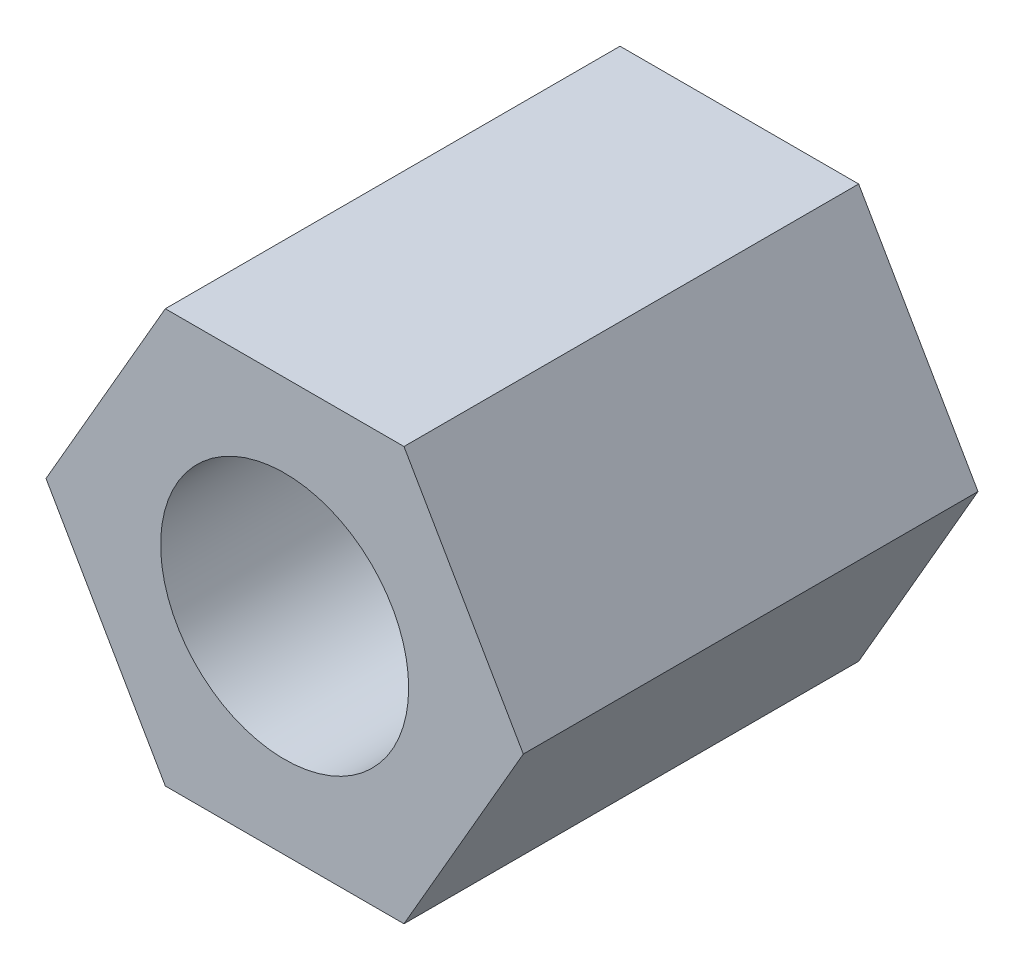
ISO-10303-21;
HEADER;
FILE_DESCRIPTION(('STEP AP214'),'2;1');
FILE_NAME('part.step','',(''),(''),'','','');
FILE_SCHEMA(('AUTOMOTIVE_DESIGN { 1 0 10303 214 1 1 1 1 }'));
ENDSEC;
DATA;
#1=APPLICATION_CONTEXT('core data for automotive mechanical design processes');
#2=APPLICATION_PROTOCOL_DEFINITION('international standard','automotive_design',2000,#1);
#3=PRODUCT_CONTEXT('',#1,'mechanical');
#4=PRODUCT('Part','Part','',(#3));
#5=PRODUCT_RELATED_PRODUCT_CATEGORY('part','',(#4));
#6=PRODUCT_DEFINITION_FORMATION('','',#4);
#7=PRODUCT_DEFINITION_CONTEXT('part definition',#1,'design');
#8=PRODUCT_DEFINITION('design','',#6,#7);
#9=PRODUCT_DEFINITION_SHAPE('','',#8);
#10=(LENGTH_UNIT() NAMED_UNIT(*) SI_UNIT(.MILLI.,.METRE.));
#11=(NAMED_UNIT(*) PLANE_ANGLE_UNIT() SI_UNIT($,.RADIAN.));
#12=(NAMED_UNIT(*) SI_UNIT($,.STERADIAN.) SOLID_ANGLE_UNIT());
#13=UNCERTAINTY_MEASURE_WITH_UNIT(LENGTH_MEASURE(1.E-05),#10,'distance_accuracy_value','');
#14=(GEOMETRIC_REPRESENTATION_CONTEXT(3) GLOBAL_UNCERTAINTY_ASSIGNED_CONTEXT((#13)) GLOBAL_UNIT_ASSIGNED_CONTEXT((#10,
#11,#12)) REPRESENTATION_CONTEXT('',''));
#15=CARTESIAN_POINT('',(0.,0.,0.));
#16=DIRECTION('',(0.,0.,1.));
#17=DIRECTION('',(1.,0.,0.));
#18=AXIS2_PLACEMENT_3D('',#15,#16,#17);
#19=CARTESIAN_POINT('',(2.88675134594813,0.,5.5));
#20=DIRECTION('',(-0.866025403784439,-0.5,0.));
#21=DIRECTION('',(0.5,-0.866025403784438,0.));
#22=AXIS2_PLACEMENT_3D('',#19,#20,#21);
#23=PLANE('',#22);
#24=DIRECTION('',(-0.5,0.866025403784439,0.));
#25=VECTOR('',#24,1.);
#26=CARTESIAN_POINT('',(2.88675134594813,0.,0.));
#27=LINE('',#26,#25);
#28=CARTESIAN_POINT('',(2.88675134594813,0.,0.));
#29=VERTEX_POINT('',#28);
#30=CARTESIAN_POINT('',(1.44337567297407,2.5,0.));
#31=VERTEX_POINT('',#30);
#32=EDGE_CURVE('E119',#29,#31,#27,.T.);
#33=ORIENTED_EDGE('',*,*,#32,.T.);
#34=DIRECTION('',(0.,0.,-1.));
#35=VECTOR('',#34,1.);
#36=CARTESIAN_POINT('',(1.44337567297407,2.5,5.5));
#37=LINE('',#36,#35);
#38=CARTESIAN_POINT('',(1.44337567297407,2.5,5.5));
#39=VERTEX_POINT('',#38);
#40=EDGE_CURVE('E11',#39,#31,#37,.T.);
#41=ORIENTED_EDGE('',*,*,#40,.F.);
#42=DIRECTION('',(-0.5,0.866025403784439,0.));
#43=VECTOR('',#42,1.);
#44=CARTESIAN_POINT('',(2.88675134594813,0.,5.5));
#45=LINE('',#44,#43);
#46=CARTESIAN_POINT('',(2.88675134594813,0.,5.5));
#47=VERTEX_POINT('',#46);
#48=EDGE_CURVE('E129',#47,#39,#45,.T.);
#49=ORIENTED_EDGE('',*,*,#48,.F.);
#50=DIRECTION('',(0.,0.,-1.));
#51=VECTOR('',#50,1.);
#52=CARTESIAN_POINT('',(2.88675134594813,0.,5.5));
#53=LINE('',#52,#51);
#54=EDGE_CURVE('E115',#47,#29,#53,.T.);
#55=ORIENTED_EDGE('',*,*,#54,.T.);
#56=EDGE_LOOP('',(#33,#41,#49,#55));
#57=FACE_BOUND('',#56,.T.);
#58=ADVANCED_FACE('F34',(#57),#23,.F.);
#59=CARTESIAN_POINT('',(1.44337567297407,2.5,5.5));
#60=DIRECTION('',(0.,-1.,0.));
#61=DIRECTION('',(1.,0.,0.));
#62=AXIS2_PLACEMENT_3D('',#59,#60,#61);
#63=PLANE('',#62);
#64=DIRECTION('',(-1.,0.,0.));
#65=VECTOR('',#64,1.);
#66=CARTESIAN_POINT('',(1.44337567297407,2.5,0.));
#67=LINE('',#66,#65);
#68=CARTESIAN_POINT('',(-1.44337567297406,2.5,0.));
#69=VERTEX_POINT('',#68);
#70=EDGE_CURVE('E122',#31,#69,#67,.T.);
#71=ORIENTED_EDGE('',*,*,#70,.T.);
#72=DIRECTION('',(0.,0.,-1.));
#73=VECTOR('',#72,1.);
#74=CARTESIAN_POINT('',(-1.44337567297406,2.5,5.5));
#75=LINE('',#74,#73);
#76=CARTESIAN_POINT('',(-1.44337567297406,2.5,5.5));
#77=VERTEX_POINT('',#76);
#78=EDGE_CURVE('E43',#77,#69,#75,.T.);
#79=ORIENTED_EDGE('',*,*,#78,.F.);
#80=DIRECTION('',(-1.,0.,0.));
#81=VECTOR('',#80,1.);
#82=CARTESIAN_POINT('',(1.44337567297407,2.5,5.5));
#83=LINE('',#82,#81);
#84=EDGE_CURVE('E88',#39,#77,#83,.T.);
#85=ORIENTED_EDGE('',*,*,#84,.F.);
#86=ORIENTED_EDGE('',*,*,#40,.T.);
#87=EDGE_LOOP('',(#71,#79,#85,#86));
#88=FACE_BOUND('',#87,.T.);
#89=ADVANCED_FACE('F155',(#88),#63,.F.);
#90=CARTESIAN_POINT('',(-1.44337567297406,2.5,5.5));
#91=DIRECTION('',(0.866025403784439,-0.5,0.));
#92=DIRECTION('',(0.5,0.866025403784439,0.));
#93=AXIS2_PLACEMENT_3D('',#90,#91,#92);
#94=PLANE('',#93);
#95=DIRECTION('',(-0.5,-0.866025403784439,0.));
#96=VECTOR('',#95,1.);
#97=CARTESIAN_POINT('',(-1.44337567297406,2.5,0.));
#98=LINE('',#97,#96);
#99=CARTESIAN_POINT('',(-2.88675134594813,0.,0.));
#100=VERTEX_POINT('',#99);
#101=EDGE_CURVE('E124',#69,#100,#98,.T.);
#102=ORIENTED_EDGE('',*,*,#101,.T.);
#103=DIRECTION('',(0.,0.,-1.));
#104=VECTOR('',#103,1.);
#105=CARTESIAN_POINT('',(-2.88675134594813,0.,5.5));
#106=LINE('',#105,#104);
#107=CARTESIAN_POINT('',(-2.88675134594813,0.,5.5));
#108=VERTEX_POINT('',#107);
#109=EDGE_CURVE('E110',#108,#100,#106,.T.);
#110=ORIENTED_EDGE('',*,*,#109,.F.);
#111=DIRECTION('',(-0.5,-0.866025403784439,0.));
#112=VECTOR('',#111,1.);
#113=CARTESIAN_POINT('',(-1.44337567297406,2.5,5.5));
#114=LINE('',#113,#112);
#115=EDGE_CURVE('E101',#77,#108,#114,.T.);
#116=ORIENTED_EDGE('',*,*,#115,.F.);
#117=ORIENTED_EDGE('',*,*,#78,.T.);
#118=EDGE_LOOP('',(#102,#110,#116,#117));
#119=FACE_BOUND('',#118,.T.);
#120=ADVANCED_FACE('F136',(#119),#94,.F.);
#121=CARTESIAN_POINT('',(-2.88675134594813,0.,5.5));
#122=DIRECTION('',(0.866025403784439,0.5,0.));
#123=DIRECTION('',(-0.5,0.866025403784439,0.));
#124=AXIS2_PLACEMENT_3D('',#121,#122,#123);
#125=PLANE('',#124);
#126=DIRECTION('',(0.5,-0.866025403784439,0.));
#127=VECTOR('',#126,1.);
#128=CARTESIAN_POINT('',(-2.88675134594813,0.,0.));
#129=LINE('',#128,#127);
#130=CARTESIAN_POINT('',(-1.44337567297406,-2.5,0.));
#131=VERTEX_POINT('',#130);
#132=EDGE_CURVE('E109',#100,#131,#129,.T.);
#133=ORIENTED_EDGE('',*,*,#132,.T.);
#134=DIRECTION('',(0.,0.,-1.));
#135=VECTOR('',#134,1.);
#136=CARTESIAN_POINT('',(-1.44337567297406,-2.5,5.5));
#137=LINE('',#136,#135);
#138=CARTESIAN_POINT('',(-1.44337567297406,-2.5,5.5));
#139=VERTEX_POINT('',#138);
#140=EDGE_CURVE('E106',#139,#131,#137,.T.);
#141=ORIENTED_EDGE('',*,*,#140,.F.);
#142=DIRECTION('',(0.5,-0.866025403784439,0.));
#143=VECTOR('',#142,1.);
#144=CARTESIAN_POINT('',(-2.88675134594813,0.,5.5));
#145=LINE('',#144,#143);
#146=EDGE_CURVE('E95',#108,#139,#145,.T.);
#147=ORIENTED_EDGE('',*,*,#146,.F.);
#148=ORIENTED_EDGE('',*,*,#109,.T.);
#149=EDGE_LOOP('',(#133,#141,#147,#148));
#150=FACE_BOUND('',#149,.T.);
#151=ADVANCED_FACE('F107',(#150),#125,.F.);
#152=CARTESIAN_POINT('',(-1.44337567297406,-2.5,5.5));
#153=DIRECTION('',(0.,1.,0.));
#154=DIRECTION('',(0.,0.,1.));
#155=AXIS2_PLACEMENT_3D('',#152,#153,#154);
#156=PLANE('',#155);
#157=DIRECTION('',(1.,0.,0.));
#158=VECTOR('',#157,1.);
#159=CARTESIAN_POINT('',(-1.44337567297406,-2.5,0.));
#160=LINE('',#159,#158);
#161=CARTESIAN_POINT('',(1.44337567297407,-2.5,0.));
#162=VERTEX_POINT('',#161);
#163=EDGE_CURVE('E74',#131,#162,#160,.T.);
#164=ORIENTED_EDGE('',*,*,#163,.T.);
#165=DIRECTION('',(0.,0.,-1.));
#166=VECTOR('',#165,1.);
#167=CARTESIAN_POINT('',(1.44337567297407,-2.5,5.5));
#168=LINE('',#167,#166);
#169=CARTESIAN_POINT('',(1.44337567297407,-2.5,5.5));
#170=VERTEX_POINT('',#169);
#171=EDGE_CURVE('E111',#170,#162,#168,.T.);
#172=ORIENTED_EDGE('',*,*,#171,.F.);
#173=DIRECTION('',(1.,0.,0.));
#174=VECTOR('',#173,1.);
#175=CARTESIAN_POINT('',(-1.44337567297406,-2.5,5.5));
#176=LINE('',#175,#174);
#177=EDGE_CURVE('E99',#139,#170,#176,.T.);
#178=ORIENTED_EDGE('',*,*,#177,.F.);
#179=ORIENTED_EDGE('',*,*,#140,.T.);
#180=EDGE_LOOP('',(#164,#172,#178,#179));
#181=FACE_BOUND('',#180,.T.);
#182=ADVANCED_FACE('F113',(#181),#156,.F.);
#183=CARTESIAN_POINT('',(1.44337567297407,-2.5,5.5));
#184=DIRECTION('',(-0.866025403784438,0.5,0.));
#185=DIRECTION('',(-0.5,-0.866025403784439,0.));
#186=AXIS2_PLACEMENT_3D('',#183,#184,#185);
#187=PLANE('',#186);
#188=DIRECTION('',(0.5,0.866025403784439,0.));
#189=VECTOR('',#188,1.);
#190=CARTESIAN_POINT('',(1.44337567297407,-2.5,0.));
#191=LINE('',#190,#189);
#192=EDGE_CURVE('E80',#162,#29,#191,.T.);
#193=ORIENTED_EDGE('',*,*,#192,.T.);
#194=ORIENTED_EDGE('',*,*,#54,.F.);
#195=DIRECTION('',(0.5,0.866025403784439,0.));
#196=VECTOR('',#195,1.);
#197=CARTESIAN_POINT('',(1.44337567297407,-2.5,5.5));
#198=LINE('',#197,#196);
#199=EDGE_CURVE('E51',#170,#47,#198,.T.);
#200=ORIENTED_EDGE('',*,*,#199,.F.);
#201=ORIENTED_EDGE('',*,*,#171,.T.);
#202=EDGE_LOOP('',(#193,#194,#200,#201));
#203=FACE_BOUND('',#202,.T.);
#204=ADVANCED_FACE('F143',(#203),#187,.F.);
#205=CARTESIAN_POINT('',(0.,0.,5.5));
#206=DIRECTION('',(0.,0.,1.));
#207=DIRECTION('',(1.,0.,0.));
#208=AXIS2_PLACEMENT_3D('',#205,#206,#207);
#209=PLANE('',#208);
#210=CARTESIAN_POINT('',(0.,0.,5.5));
#211=DIRECTION('',(0.,0.,1.));
#212=DIRECTION('',(1.,0.,0.));
#213=AXIS2_PLACEMENT_3D('',#210,#211,#212);
#214=CIRCLE('',#213,1.5);
#215=CARTESIAN_POINT('',(1.5,0.,5.5));
#216=VERTEX_POINT('',#215);
#217=EDGE_CURVE('E208',#216,#216,#214,.T.);
#218=ORIENTED_EDGE('',*,*,#217,.F.);
#219=EDGE_LOOP('',(#218));
#220=FACE_BOUND('',#219,.T.);
#221=ORIENTED_EDGE('',*,*,#48,.T.);
#222=ORIENTED_EDGE('',*,*,#84,.T.);
#223=ORIENTED_EDGE('',*,*,#115,.T.);
#224=ORIENTED_EDGE('',*,*,#146,.T.);
#225=ORIENTED_EDGE('',*,*,#177,.T.);
#226=ORIENTED_EDGE('',*,*,#199,.T.);
#227=EDGE_LOOP('',(#221,#222,#223,#224,#225,#226));
#228=FACE_BOUND('',#227,.T.);
#229=ADVANCED_FACE('F97',(#220,#228),#209,.T.);
#230=CARTESIAN_POINT('',(0.,0.,0.));
#231=DIRECTION('',(0.,0.,1.));
#232=DIRECTION('',(1.,0.,0.));
#233=AXIS2_PLACEMENT_3D('',#230,#231,#232);
#234=PLANE('',#233);
#235=CARTESIAN_POINT('',(0.,0.,0.));
#236=DIRECTION('',(0.,0.,1.));
#237=DIRECTION('',(1.,0.,0.));
#238=AXIS2_PLACEMENT_3D('',#235,#236,#237);
#239=CIRCLE('',#238,1.5);
#240=CARTESIAN_POINT('',(1.5,0.,0.));
#241=VERTEX_POINT('',#240);
#242=EDGE_CURVE('E37',#241,#241,#239,.T.);
#243=ORIENTED_EDGE('',*,*,#242,.T.);
#244=EDGE_LOOP('',(#243));
#245=FACE_BOUND('',#244,.T.);
#246=ORIENTED_EDGE('',*,*,#32,.F.);
#247=ORIENTED_EDGE('',*,*,#192,.F.);
#248=ORIENTED_EDGE('',*,*,#163,.F.);
#249=ORIENTED_EDGE('',*,*,#132,.F.);
#250=ORIENTED_EDGE('',*,*,#101,.F.);
#251=ORIENTED_EDGE('',*,*,#70,.F.);
#252=EDGE_LOOP('',(#246,#247,#248,#249,#250,#251));
#253=FACE_BOUND('',#252,.T.);
#254=ADVANCED_FACE('F139',(#245,#253),#234,.F.);
#255=CARTESIAN_POINT('',(0.,0.,-9.5));
#256=DIRECTION('',(0.,0.,1.));
#257=DIRECTION('',(1.,0.,0.));
#258=AXIS2_PLACEMENT_3D('',#255,#256,#257);
#259=CYLINDRICAL_SURFACE('',#258,1.5);
#260=ORIENTED_EDGE('',*,*,#217,.T.);
#261=EDGE_LOOP('',(#260));
#262=FACE_BOUND('',#261,.T.);
#263=ORIENTED_EDGE('',*,*,#242,.F.);
#264=EDGE_LOOP('',(#263));
#265=FACE_BOUND('',#264,.T.);
#266=ADVANCED_FACE('F192',(#262,#265),#259,.F.);
#267=CLOSED_SHELL('',(#58,#89,#120,#151,#182,#204,#229,#254,#266));
#268=MANIFOLD_SOLID_BREP('B2',#267);
#269=ADVANCED_BREP_SHAPE_REPRESENTATION('',(#18,#268),#14);
#270=SHAPE_DEFINITION_REPRESENTATION(#9,#269);
ENDSEC;
END-ISO-10303-21;
